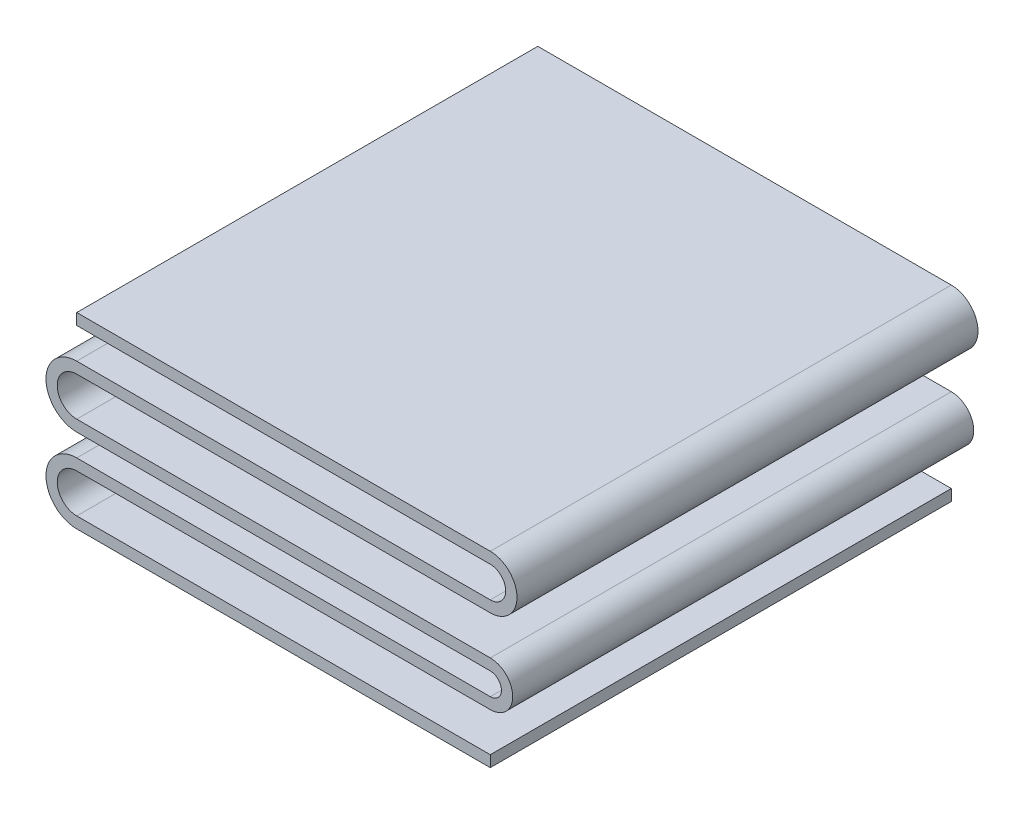
ISO-10303-21;
HEADER;
FILE_DESCRIPTION(('STEP AP214'),'2;1');
FILE_NAME('part.step','',(''),(''),'','','');
FILE_SCHEMA(('AUTOMOTIVE_DESIGN { 1 0 10303 214 1 1 1 1 }'));
ENDSEC;
DATA;
#1=APPLICATION_CONTEXT('core data for automotive mechanical design processes');
#2=APPLICATION_PROTOCOL_DEFINITION('international standard','automotive_design',2000,#1);
#3=PRODUCT_CONTEXT('',#1,'mechanical');
#4=PRODUCT('Part','Part','',(#3));
#5=PRODUCT_RELATED_PRODUCT_CATEGORY('part','',(#4));
#6=PRODUCT_DEFINITION_FORMATION('','',#4);
#7=PRODUCT_DEFINITION_CONTEXT('part definition',#1,'design');
#8=PRODUCT_DEFINITION('design','',#6,#7);
#9=PRODUCT_DEFINITION_SHAPE('','',#8);
#10=(LENGTH_UNIT() NAMED_UNIT(*) SI_UNIT(.MILLI.,.METRE.));
#11=(NAMED_UNIT(*) PLANE_ANGLE_UNIT() SI_UNIT($,.RADIAN.));
#12=(NAMED_UNIT(*) SI_UNIT($,.STERADIAN.) SOLID_ANGLE_UNIT());
#13=UNCERTAINTY_MEASURE_WITH_UNIT(LENGTH_MEASURE(1.E-05),#10,'distance_accuracy_value','');
#14=(GEOMETRIC_REPRESENTATION_CONTEXT(3) GLOBAL_UNCERTAINTY_ASSIGNED_CONTEXT((#13)) GLOBAL_UNIT_ASSIGNED_CONTEXT((#10,
#11,#12)) REPRESENTATION_CONTEXT('',''));
#15=CARTESIAN_POINT('',(0.,0.,0.));
#16=DIRECTION('',(0.,0.,1.));
#17=DIRECTION('',(1.,0.,0.));
#18=AXIS2_PLACEMENT_3D('',#15,#16,#17);
#19=CARTESIAN_POINT('',(-7.00550510540419,0.660795162104659,15.621));
#20=DIRECTION('',(0.,0.,-1.));
#21=DIRECTION('',(-1.,0.,0.));
#22=AXIS2_PLACEMENT_3D('',#19,#20,#21);
#23=CYLINDRICAL_SURFACE('',#22,0.660795162104659);
#24=CARTESIAN_POINT('',(-7.00550510540419,0.660795162104659,0.));
#25=DIRECTION('',(0.,0.,-1.));
#26=DIRECTION('',(-1.,0.,0.));
#27=AXIS2_PLACEMENT_3D('',#24,#25,#26);
#28=CIRCLE('',#27,0.660795162104659);
#29=CARTESIAN_POINT('',(-7.00550510540419,0.,0.));
#30=VERTEX_POINT('',#29);
#31=CARTESIAN_POINT('',(-7.00550510540419,1.32159032420932,0.));
#32=VERTEX_POINT('',#31);
#33=EDGE_CURVE('E218',#30,#32,#28,.T.);
#34=ORIENTED_EDGE('',*,*,#33,.T.);
#35=DIRECTION('',(0.,0.,-1.));
#36=VECTOR('',#35,1.);
#37=CARTESIAN_POINT('',(-7.00550510540419,1.32159032420932,15.621));
#38=LINE('',#37,#36);
#39=CARTESIAN_POINT('',(-7.00550510540419,1.32159032420932,15.621));
#40=VERTEX_POINT('',#39);
#41=EDGE_CURVE('E11',#40,#32,#38,.T.);
#42=ORIENTED_EDGE('',*,*,#41,.F.);
#43=CARTESIAN_POINT('',(-7.00550510540419,0.660795162104659,15.621));
#44=DIRECTION('',(0.,0.,-1.));
#45=DIRECTION('',(-1.,0.,0.));
#46=AXIS2_PLACEMENT_3D('',#43,#44,#45);
#47=CIRCLE('',#46,0.660795162104659);
#48=CARTESIAN_POINT('',(-7.00550510540419,0.,15.621));
#49=VERTEX_POINT('',#48);
#50=EDGE_CURVE('E276',#49,#40,#47,.T.);
#51=ORIENTED_EDGE('',*,*,#50,.F.);
#52=DIRECTION('',(0.,0.,-1.));
#53=VECTOR('',#52,1.);
#54=CARTESIAN_POINT('',(-7.00550510540419,0.,15.621));
#55=LINE('',#54,#53);
#56=EDGE_CURVE('E214',#49,#30,#55,.T.);
#57=ORIENTED_EDGE('',*,*,#56,.T.);
#58=EDGE_LOOP('',(#34,#42,#51,#57));
#59=FACE_BOUND('',#58,.T.);
#60=ADVANCED_FACE('F45',(#59),#23,.F.);
#61=CARTESIAN_POINT('',(-7.00550510540419,1.32159032420932,15.621));
#62=DIRECTION('',(0.,1.,0.));
#63=DIRECTION('',(0.,0.,1.));
#64=AXIS2_PLACEMENT_3D('',#61,#62,#63);
#65=PLANE('',#64);
#66=DIRECTION('',(1.,0.,0.));
#67=VECTOR('',#66,1.);
#68=CARTESIAN_POINT('',(-7.00550510540419,1.32159032420932,0.));
#69=LINE('',#68,#67);
#70=CARTESIAN_POINT('',(7.00550510540419,1.32159032420932,0.));
#71=VERTEX_POINT('',#70);
#72=EDGE_CURVE('E222',#32,#71,#69,.T.);
#73=ORIENTED_EDGE('',*,*,#72,.T.);
#74=DIRECTION('',(0.,0.,-1.));
#75=VECTOR('',#74,1.);
#76=CARTESIAN_POINT('',(7.00550510540419,1.32159032420932,15.621));
#77=LINE('',#76,#75);
#78=CARTESIAN_POINT('',(7.00550510540419,1.32159032420932,15.621));
#79=VERTEX_POINT('',#78);
#80=EDGE_CURVE('E54',#79,#71,#77,.T.);
#81=ORIENTED_EDGE('',*,*,#80,.F.);
#82=DIRECTION('',(1.,0.,0.));
#83=VECTOR('',#82,1.);
#84=CARTESIAN_POINT('',(-7.00550510540419,1.32159032420932,15.621));
#85=LINE('',#84,#83);
#86=EDGE_CURVE('E141',#40,#79,#85,.T.);
#87=ORIENTED_EDGE('',*,*,#86,.F.);
#88=ORIENTED_EDGE('',*,*,#41,.T.);
#89=EDGE_LOOP('',(#73,#81,#87,#88));
#90=FACE_BOUND('',#89,.T.);
#91=ADVANCED_FACE('F426',(#90),#65,.F.);
#92=CARTESIAN_POINT('',(7.00550510540419,2.2252937493264,15.621));
#93=DIRECTION('',(0.,0.,-1.));
#94=DIRECTION('',(-1.,0.,0.));
#95=AXIS2_PLACEMENT_3D('',#92,#93,#94);
#96=CYLINDRICAL_SURFACE('',#95,0.903703425117078);
#97=CARTESIAN_POINT('',(7.00550510540419,2.2252937493264,0.));
#98=DIRECTION('',(0.,0.,1.));
#99=DIRECTION('',(1.,0.,0.));
#100=AXIS2_PLACEMENT_3D('',#97,#98,#99);
#101=CIRCLE('',#100,0.903703425117078);
#102=CARTESIAN_POINT('',(7.00550510540419,3.12899717444347,0.));
#103=VERTEX_POINT('',#102);
#104=EDGE_CURVE('E225',#71,#103,#101,.T.);
#105=ORIENTED_EDGE('',*,*,#104,.T.);
#106=DIRECTION('',(0.,0.,-1.));
#107=VECTOR('',#106,1.);
#108=CARTESIAN_POINT('',(7.00550510540419,3.12899717444347,15.621));
#109=LINE('',#108,#107);
#110=CARTESIAN_POINT('',(7.00550510540419,3.12899717444347,15.621));
#111=VERTEX_POINT('',#110);
#112=EDGE_CURVE('E335',#111,#103,#109,.T.);
#113=ORIENTED_EDGE('',*,*,#112,.F.);
#114=CARTESIAN_POINT('',(7.00550510540419,2.2252937493264,15.621));
#115=DIRECTION('',(0.,0.,1.));
#116=DIRECTION('',(1.,0.,0.));
#117=AXIS2_PLACEMENT_3D('',#114,#115,#116);
#118=CIRCLE('',#117,0.903703425117078);
#119=EDGE_CURVE('E345',#79,#111,#118,.T.);
#120=ORIENTED_EDGE('',*,*,#119,.F.);
#121=ORIENTED_EDGE('',*,*,#80,.T.);
#122=EDGE_LOOP('',(#105,#113,#120,#121));
#123=FACE_BOUND('',#122,.T.);
#124=ADVANCED_FACE('F343',(#123),#96,.T.);
#125=CARTESIAN_POINT('',(7.00550510540419,3.12899717444347,15.621));
#126=DIRECTION('',(0.,-1.,0.));
#127=DIRECTION('',(0.,0.,-1.));
#128=AXIS2_PLACEMENT_3D('',#125,#126,#127);
#129=PLANE('',#128);
#130=DIRECTION('',(-1.,0.,0.));
#131=VECTOR('',#130,1.);
#132=CARTESIAN_POINT('',(7.00550510540419,3.12899717444347,0.));
#133=LINE('',#132,#131);
#134=CARTESIAN_POINT('',(-7.0055051054042,3.12899717444347,0.));
#135=VERTEX_POINT('',#134);
#136=EDGE_CURVE('E228',#103,#135,#133,.T.);
#137=ORIENTED_EDGE('',*,*,#136,.T.);
#138=DIRECTION('',(0.,0.,-1.));
#139=VECTOR('',#138,1.);
#140=CARTESIAN_POINT('',(-7.0055051054042,3.12899717444347,15.621));
#141=LINE('',#140,#139);
#142=CARTESIAN_POINT('',(-7.0055051054042,3.12899717444347,15.621));
#143=VERTEX_POINT('',#142);
#144=EDGE_CURVE('E331',#143,#135,#141,.T.);
#145=ORIENTED_EDGE('',*,*,#144,.F.);
#146=DIRECTION('',(-1.,0.,0.));
#147=VECTOR('',#146,1.);
#148=CARTESIAN_POINT('',(7.00550510540419,3.12899717444347,15.621));
#149=LINE('',#148,#147);
#150=EDGE_CURVE('E364',#111,#143,#149,.T.);
#151=ORIENTED_EDGE('',*,*,#150,.F.);
#152=ORIENTED_EDGE('',*,*,#112,.T.);
#153=EDGE_LOOP('',(#137,#145,#151,#152));
#154=FACE_BOUND('',#153,.T.);
#155=ADVANCED_FACE('F354',(#154),#129,.F.);
#156=CARTESIAN_POINT('',(-7.0055051054042,3.12899717444347,15.621));
#157=DIRECTION('',(1.,0.,0.));
#158=DIRECTION('',(0.,1.,0.));
#159=AXIS2_PLACEMENT_3D('',#156,#157,#158);
#160=PLANE('',#159);
#161=DIRECTION('',(0.,-1.,0.));
#162=VECTOR('',#161,1.);
#163=CARTESIAN_POINT('',(-7.0055051054042,3.12899717444347,0.));
#164=LINE('',#163,#162);
#165=CARTESIAN_POINT('',(-7.00550510540419,2.74799717444347,0.));
#166=VERTEX_POINT('',#165);
#167=EDGE_CURVE('E231',#135,#166,#164,.T.);
#168=ORIENTED_EDGE('',*,*,#167,.T.);
#169=DIRECTION('',(0.,0.,-1.));
#170=VECTOR('',#169,1.);
#171=CARTESIAN_POINT('',(-7.00550510540419,2.74799717444347,15.621));
#172=LINE('',#171,#170);
#173=CARTESIAN_POINT('',(-7.00550510540419,2.74799717444347,15.621));
#174=VERTEX_POINT('',#173);
#175=EDGE_CURVE('E327',#174,#166,#172,.T.);
#176=ORIENTED_EDGE('',*,*,#175,.F.);
#177=DIRECTION('',(0.,-1.,0.));
#178=VECTOR('',#177,1.);
#179=CARTESIAN_POINT('',(-7.0055051054042,3.12899717444347,15.621));
#180=LINE('',#179,#178);
#181=EDGE_CURVE('E360',#143,#174,#180,.T.);
#182=ORIENTED_EDGE('',*,*,#181,.F.);
#183=ORIENTED_EDGE('',*,*,#144,.T.);
#184=EDGE_LOOP('',(#168,#176,#182,#183));
#185=FACE_BOUND('',#184,.T.);
#186=ADVANCED_FACE('F358',(#185),#160,.F.);
#187=CARTESIAN_POINT('',(7.00550510540419,2.74799717444347,15.621));
#188=DIRECTION('',(0.,1.,0.));
#189=DIRECTION('',(-1.,0.,0.));
#190=AXIS2_PLACEMENT_3D('',#187,#188,#189);
#191=PLANE('',#190);
#192=DIRECTION('',(1.,0.,0.));
#193=VECTOR('',#192,1.);
#194=CARTESIAN_POINT('',(7.00550510540419,2.74799717444347,0.));
#195=LINE('',#194,#193);
#196=CARTESIAN_POINT('',(7.00550510540419,2.74799717444347,0.));
#197=VERTEX_POINT('',#196);
#198=EDGE_CURVE('E234',#166,#197,#195,.T.);
#199=ORIENTED_EDGE('',*,*,#198,.T.);
#200=DIRECTION('',(0.,0.,-1.));
#201=VECTOR('',#200,1.);
#202=CARTESIAN_POINT('',(7.00550510540419,2.74799717444347,15.621));
#203=LINE('',#202,#201);
#204=CARTESIAN_POINT('',(7.00550510540419,2.74799717444347,15.621));
#205=VERTEX_POINT('',#204);
#206=EDGE_CURVE('E323',#205,#197,#203,.T.);
#207=ORIENTED_EDGE('',*,*,#206,.F.);
#208=DIRECTION('',(1.,0.,0.));
#209=VECTOR('',#208,1.);
#210=CARTESIAN_POINT('',(7.00550510540419,2.74799717444347,15.621));
#211=LINE('',#210,#209);
#212=EDGE_CURVE('E363',#174,#205,#211,.T.);
#213=ORIENTED_EDGE('',*,*,#212,.F.);
#214=ORIENTED_EDGE('',*,*,#175,.T.);
#215=EDGE_LOOP('',(#199,#207,#213,#214));
#216=FACE_BOUND('',#215,.T.);
#217=ADVANCED_FACE('F439',(#216),#191,.F.);
#218=CARTESIAN_POINT('',(7.00550510540419,2.2252937493264,15.621));
#219=DIRECTION('',(0.,0.,-1.));
#220=DIRECTION('',(-1.,0.,0.));
#221=AXIS2_PLACEMENT_3D('',#218,#219,#220);
#222=CYLINDRICAL_SURFACE('',#221,0.522703425117078);
#223=CARTESIAN_POINT('',(7.00550510540419,2.2252937493264,0.));
#224=DIRECTION('',(0.,0.,-1.));
#225=DIRECTION('',(1.,0.,0.));
#226=AXIS2_PLACEMENT_3D('',#223,#224,#225);
#227=CIRCLE('',#226,0.522703425117078);
#228=CARTESIAN_POINT('',(7.00550510540419,1.70259032420932,0.));
#229=VERTEX_POINT('',#228);
#230=EDGE_CURVE('E237',#197,#229,#227,.T.);
#231=ORIENTED_EDGE('',*,*,#230,.T.);
#232=DIRECTION('',(0.,0.,-1.));
#233=VECTOR('',#232,1.);
#234=CARTESIAN_POINT('',(7.00550510540419,1.70259032420932,15.621));
#235=LINE('',#234,#233);
#236=CARTESIAN_POINT('',(7.00550510540419,1.70259032420932,15.621));
#237=VERTEX_POINT('',#236);
#238=EDGE_CURVE('E319',#237,#229,#235,.T.);
#239=ORIENTED_EDGE('',*,*,#238,.F.);
#240=CARTESIAN_POINT('',(7.00550510540419,2.2252937493264,15.621));
#241=DIRECTION('',(0.,0.,-1.));
#242=DIRECTION('',(1.,0.,0.));
#243=AXIS2_PLACEMENT_3D('',#240,#241,#242);
#244=CIRCLE('',#243,0.522703425117078);
#245=EDGE_CURVE('E368',#205,#237,#244,.T.);
#246=ORIENTED_EDGE('',*,*,#245,.F.);
#247=ORIENTED_EDGE('',*,*,#206,.T.);
#248=EDGE_LOOP('',(#231,#239,#246,#247));
#249=FACE_BOUND('',#248,.T.);
#250=ADVANCED_FACE('F442',(#249),#222,.F.);
#251=CARTESIAN_POINT('',(-7.00550510540419,1.70259032420932,15.621));
#252=DIRECTION('',(0.,-1.,0.));
#253=DIRECTION('',(0.,0.,-1.));
#254=AXIS2_PLACEMENT_3D('',#251,#252,#253);
#255=PLANE('',#254);
#256=DIRECTION('',(-1.,0.,0.));
#257=VECTOR('',#256,1.);
#258=CARTESIAN_POINT('',(-7.00550510540419,1.70259032420932,0.));
#259=LINE('',#258,#257);
#260=CARTESIAN_POINT('',(-7.00550510540419,1.70259032420932,0.));
#261=VERTEX_POINT('',#260);
#262=EDGE_CURVE('E240',#229,#261,#259,.T.);
#263=ORIENTED_EDGE('',*,*,#262,.T.);
#264=DIRECTION('',(0.,0.,-1.));
#265=VECTOR('',#264,1.);
#266=CARTESIAN_POINT('',(-7.00550510540419,1.70259032420932,15.621));
#267=LINE('',#266,#265);
#268=CARTESIAN_POINT('',(-7.00550510540419,1.70259032420932,15.621));
#269=VERTEX_POINT('',#268);
#270=EDGE_CURVE('E315',#269,#261,#267,.T.);
#271=ORIENTED_EDGE('',*,*,#270,.F.);
#272=DIRECTION('',(-1.,0.,0.));
#273=VECTOR('',#272,1.);
#274=CARTESIAN_POINT('',(-7.00550510540419,1.70259032420932,15.621));
#275=LINE('',#274,#273);
#276=EDGE_CURVE('E375',#237,#269,#275,.T.);
#277=ORIENTED_EDGE('',*,*,#276,.F.);
#278=ORIENTED_EDGE('',*,*,#238,.T.);
#279=EDGE_LOOP('',(#263,#271,#277,#278));
#280=FACE_BOUND('',#279,.T.);
#281=ADVANCED_FACE('F446',(#280),#255,.F.);
#282=CARTESIAN_POINT('',(-7.00550510540419,0.660795162104659,15.621));
#283=DIRECTION('',(0.,0.,-1.));
#284=DIRECTION('',(-1.,0.,0.));
#285=AXIS2_PLACEMENT_3D('',#282,#283,#284);
#286=CYLINDRICAL_SURFACE('',#285,1.04179516210466);
#287=CARTESIAN_POINT('',(-7.00550510540419,0.660795162104659,0.));
#288=DIRECTION('',(0.,0.,1.));
#289=DIRECTION('',(-1.,0.,0.));
#290=AXIS2_PLACEMENT_3D('',#287,#288,#289);
#291=CIRCLE('',#290,1.04179516210466);
#292=CARTESIAN_POINT('',(-7.00550510540419,-0.381,0.));
#293=VERTEX_POINT('',#292);
#294=EDGE_CURVE('E243',#261,#293,#291,.T.);
#295=ORIENTED_EDGE('',*,*,#294,.T.);
#296=DIRECTION('',(0.,0.,-1.));
#297=VECTOR('',#296,1.);
#298=CARTESIAN_POINT('',(-7.00550510540419,-0.381,15.621));
#299=LINE('',#298,#297);
#300=CARTESIAN_POINT('',(-7.00550510540419,-0.381,15.621));
#301=VERTEX_POINT('',#300);
#302=EDGE_CURVE('E311',#301,#293,#299,.T.);
#303=ORIENTED_EDGE('',*,*,#302,.F.);
#304=CARTESIAN_POINT('',(-7.00550510540419,0.660795162104659,15.621));
#305=DIRECTION('',(0.,0.,1.));
#306=DIRECTION('',(-1.,0.,0.));
#307=AXIS2_PLACEMENT_3D('',#304,#305,#306);
#308=CIRCLE('',#307,1.04179516210466);
#309=EDGE_CURVE('E378',#269,#301,#308,.T.);
#310=ORIENTED_EDGE('',*,*,#309,.F.);
#311=ORIENTED_EDGE('',*,*,#270,.T.);
#312=EDGE_LOOP('',(#295,#303,#310,#311));
#313=FACE_BOUND('',#312,.T.);
#314=ADVANCED_FACE('F450',(#313),#286,.T.);
#315=CARTESIAN_POINT('',(-7.00550510540419,-0.381,15.621));
#316=DIRECTION('',(0.,1.,0.));
#317=DIRECTION('',(0.,0.,1.));
#318=AXIS2_PLACEMENT_3D('',#315,#316,#317);
#319=PLANE('',#318);
#320=DIRECTION('',(1.,0.,0.));
#321=VECTOR('',#320,1.);
#322=CARTESIAN_POINT('',(-7.00550510540419,-0.381,0.));
#323=LINE('',#322,#321);
#324=CARTESIAN_POINT('',(7.00550510540419,-0.381,0.));
#325=VERTEX_POINT('',#324);
#326=EDGE_CURVE('E246',#293,#325,#323,.T.);
#327=ORIENTED_EDGE('',*,*,#326,.T.);
#328=DIRECTION('',(0.,0.,-1.));
#329=VECTOR('',#328,1.);
#330=CARTESIAN_POINT('',(7.00550510540419,-0.381,15.621));
#331=LINE('',#330,#329);
#332=CARTESIAN_POINT('',(7.00550510540419,-0.381,15.621));
#333=VERTEX_POINT('',#332);
#334=EDGE_CURVE('E307',#333,#325,#331,.T.);
#335=ORIENTED_EDGE('',*,*,#334,.F.);
#336=DIRECTION('',(1.,0.,0.));
#337=VECTOR('',#336,1.);
#338=CARTESIAN_POINT('',(-7.00550510540419,-0.381,15.621));
#339=LINE('',#338,#337);
#340=EDGE_CURVE('E381',#301,#333,#339,.T.);
#341=ORIENTED_EDGE('',*,*,#340,.F.);
#342=ORIENTED_EDGE('',*,*,#302,.T.);
#343=EDGE_LOOP('',(#327,#335,#341,#342));
#344=FACE_BOUND('',#343,.T.);
#345=ADVANCED_FACE('F454',(#344),#319,.F.);
#346=CARTESIAN_POINT('',(7.00550510540419,-0.759206250673604,15.621));
#347=DIRECTION('',(0.,0.,-1.));
#348=DIRECTION('',(-1.,0.,0.));
#349=AXIS2_PLACEMENT_3D('',#346,#347,#348);
#350=CYLINDRICAL_SURFACE('',#349,0.378206250673604);
#351=CARTESIAN_POINT('',(7.00550510540419,-0.759206250673604,0.));
#352=DIRECTION('',(0.,0.,-1.));
#353=DIRECTION('',(-1.,0.,0.));
#354=AXIS2_PLACEMENT_3D('',#351,#352,#353);
#355=CIRCLE('',#354,0.378206250673604);
#356=CARTESIAN_POINT('',(7.00550510540419,-1.13741250134721,0.));
#357=VERTEX_POINT('',#356);
#358=EDGE_CURVE('E249',#325,#357,#355,.T.);
#359=ORIENTED_EDGE('',*,*,#358,.T.);
#360=DIRECTION('',(0.,0.,-1.));
#361=VECTOR('',#360,1.);
#362=CARTESIAN_POINT('',(7.00550510540419,-1.13741250134721,15.621));
#363=LINE('',#362,#361);
#364=CARTESIAN_POINT('',(7.00550510540419,-1.13741250134721,15.621));
#365=VERTEX_POINT('',#364);
#366=EDGE_CURVE('E303',#365,#357,#363,.T.);
#367=ORIENTED_EDGE('',*,*,#366,.F.);
#368=CARTESIAN_POINT('',(7.00550510540419,-0.759206250673604,15.621));
#369=DIRECTION('',(0.,0.,-1.));
#370=DIRECTION('',(-1.,0.,0.));
#371=AXIS2_PLACEMENT_3D('',#368,#369,#370);
#372=CIRCLE('',#371,0.378206250673604);
#373=EDGE_CURVE('E384',#333,#365,#372,.T.);
#374=ORIENTED_EDGE('',*,*,#373,.F.);
#375=ORIENTED_EDGE('',*,*,#334,.T.);
#376=EDGE_LOOP('',(#359,#367,#374,#375));
#377=FACE_BOUND('',#376,.T.);
#378=ADVANCED_FACE('F458',(#377),#350,.F.);
#379=CARTESIAN_POINT('',(7.00550510540419,-1.13741250134721,15.621));
#380=DIRECTION('',(0.,-1.,0.));
#381=DIRECTION('',(0.,0.,-1.));
#382=AXIS2_PLACEMENT_3D('',#379,#380,#381);
#383=PLANE('',#382);
#384=DIRECTION('',(-1.,0.,0.));
#385=VECTOR('',#384,1.);
#386=CARTESIAN_POINT('',(7.00550510540419,-1.13741250134721,0.));
#387=LINE('',#386,#385);
#388=CARTESIAN_POINT('',(-7.00550510540419,-1.13741250134721,0.));
#389=VERTEX_POINT('',#388);
#390=EDGE_CURVE('E252',#357,#389,#387,.T.);
#391=ORIENTED_EDGE('',*,*,#390,.T.);
#392=DIRECTION('',(0.,0.,-1.));
#393=VECTOR('',#392,1.);
#394=CARTESIAN_POINT('',(-7.00550510540419,-1.13741250134721,15.621));
#395=LINE('',#394,#393);
#396=CARTESIAN_POINT('',(-7.00550510540419,-1.13741250134721,15.621));
#397=VERTEX_POINT('',#396);
#398=EDGE_CURVE('E299',#397,#389,#395,.T.);
#399=ORIENTED_EDGE('',*,*,#398,.F.);
#400=DIRECTION('',(-1.,0.,0.));
#401=VECTOR('',#400,1.);
#402=CARTESIAN_POINT('',(7.00550510540419,-1.13741250134721,15.621));
#403=LINE('',#402,#401);
#404=EDGE_CURVE('E387',#365,#397,#403,.T.);
#405=ORIENTED_EDGE('',*,*,#404,.F.);
#406=ORIENTED_EDGE('',*,*,#366,.T.);
#407=EDGE_LOOP('',(#391,#399,#405,#406));
#408=FACE_BOUND('',#407,.T.);
#409=ADVANCED_FACE('F462',(#408),#383,.F.);
#410=CARTESIAN_POINT('',(-7.00550510540419,-2.17920766345187,15.621));
#411=DIRECTION('',(0.,0.,-1.));
#412=DIRECTION('',(-1.,0.,0.));
#413=AXIS2_PLACEMENT_3D('',#410,#411,#412);
#414=CYLINDRICAL_SURFACE('',#413,1.04179516210466);
#415=CARTESIAN_POINT('',(-7.00550510540419,-2.17920766345187,0.));
#416=DIRECTION('',(0.,0.,1.));
#417=DIRECTION('',(1.,0.,0.));
#418=AXIS2_PLACEMENT_3D('',#415,#416,#417);
#419=CIRCLE('',#418,1.04179516210466);
#420=CARTESIAN_POINT('',(-7.00550510540419,-3.22100282555653,0.));
#421=VERTEX_POINT('',#420);
#422=EDGE_CURVE('E255',#389,#421,#419,.T.);
#423=ORIENTED_EDGE('',*,*,#422,.T.);
#424=DIRECTION('',(0.,0.,-1.));
#425=VECTOR('',#424,1.);
#426=CARTESIAN_POINT('',(-7.00550510540419,-3.22100282555653,15.621));
#427=LINE('',#426,#425);
#428=CARTESIAN_POINT('',(-7.00550510540419,-3.22100282555653,15.621));
#429=VERTEX_POINT('',#428);
#430=EDGE_CURVE('E295',#429,#421,#427,.T.);
#431=ORIENTED_EDGE('',*,*,#430,.F.);
#432=CARTESIAN_POINT('',(-7.00550510540419,-2.17920766345187,15.621));
#433=DIRECTION('',(0.,0.,1.));
#434=DIRECTION('',(1.,0.,0.));
#435=AXIS2_PLACEMENT_3D('',#432,#433,#434);
#436=CIRCLE('',#435,1.04179516210466);
#437=EDGE_CURVE('E390',#397,#429,#436,.T.);
#438=ORIENTED_EDGE('',*,*,#437,.F.);
#439=ORIENTED_EDGE('',*,*,#398,.T.);
#440=EDGE_LOOP('',(#423,#431,#438,#439));
#441=FACE_BOUND('',#440,.T.);
#442=ADVANCED_FACE('F466',(#441),#414,.T.);
#443=CARTESIAN_POINT('',(-7.00550510540419,-3.22100282555653,15.621));
#444=DIRECTION('',(0.,1.,0.));
#445=DIRECTION('',(0.,0.,1.));
#446=AXIS2_PLACEMENT_3D('',#443,#444,#445);
#447=PLANE('',#446);
#448=DIRECTION('',(1.,0.,0.));
#449=VECTOR('',#448,1.);
#450=CARTESIAN_POINT('',(-7.00550510540419,-3.22100282555653,0.));
#451=LINE('',#450,#449);
#452=CARTESIAN_POINT('',(7.00550510540419,-3.22100282555653,0.));
#453=VERTEX_POINT('',#452);
#454=EDGE_CURVE('E258',#421,#453,#451,.T.);
#455=ORIENTED_EDGE('',*,*,#454,.T.);
#456=DIRECTION('',(0.,0.,-1.));
#457=VECTOR('',#456,1.);
#458=CARTESIAN_POINT('',(7.00550510540419,-3.22100282555653,15.621));
#459=LINE('',#458,#457);
#460=CARTESIAN_POINT('',(7.00550510540419,-3.22100282555653,15.621));
#461=VERTEX_POINT('',#460);
#462=EDGE_CURVE('E291',#461,#453,#459,.T.);
#463=ORIENTED_EDGE('',*,*,#462,.F.);
#464=DIRECTION('',(1.,0.,0.));
#465=VECTOR('',#464,1.);
#466=CARTESIAN_POINT('',(-7.00550510540419,-3.22100282555653,15.621));
#467=LINE('',#466,#465);
#468=EDGE_CURVE('E393',#429,#461,#467,.T.);
#469=ORIENTED_EDGE('',*,*,#468,.F.);
#470=ORIENTED_EDGE('',*,*,#430,.T.);
#471=EDGE_LOOP('',(#455,#463,#469,#470));
#472=FACE_BOUND('',#471,.T.);
#473=ADVANCED_FACE('F470',(#472),#447,.F.);
#474=CARTESIAN_POINT('',(7.00550510540419,-3.22100282555653,15.621));
#475=DIRECTION('',(-1.,0.,0.));
#476=DIRECTION('',(0.,-1.,0.));
#477=AXIS2_PLACEMENT_3D('',#474,#475,#476);
#478=PLANE('',#477);
#479=DIRECTION('',(0.,1.,0.));
#480=VECTOR('',#479,1.);
#481=CARTESIAN_POINT('',(7.00550510540419,-3.22100282555653,0.));
#482=LINE('',#481,#480);
#483=CARTESIAN_POINT('',(7.00550510540419,-2.84000282555653,0.));
#484=VERTEX_POINT('',#483);
#485=EDGE_CURVE('E261',#453,#484,#482,.T.);
#486=ORIENTED_EDGE('',*,*,#485,.T.);
#487=DIRECTION('',(0.,0.,-1.));
#488=VECTOR('',#487,1.);
#489=CARTESIAN_POINT('',(7.00550510540419,-2.84000282555653,15.621));
#490=LINE('',#489,#488);
#491=CARTESIAN_POINT('',(7.00550510540419,-2.84000282555653,15.621));
#492=VERTEX_POINT('',#491);
#493=EDGE_CURVE('E287',#492,#484,#490,.T.);
#494=ORIENTED_EDGE('',*,*,#493,.F.);
#495=DIRECTION('',(0.,1.,0.));
#496=VECTOR('',#495,1.);
#497=CARTESIAN_POINT('',(7.00550510540419,-3.22100282555653,15.621));
#498=LINE('',#497,#496);
#499=EDGE_CURVE('E396',#461,#492,#498,.T.);
#500=ORIENTED_EDGE('',*,*,#499,.F.);
#501=ORIENTED_EDGE('',*,*,#462,.T.);
#502=EDGE_LOOP('',(#486,#494,#500,#501));
#503=FACE_BOUND('',#502,.T.);
#504=ADVANCED_FACE('F474',(#503),#478,.F.);
#505=CARTESIAN_POINT('',(-7.00550510540419,-2.84000282555653,15.621));
#506=DIRECTION('',(0.,-1.,0.));
#507=DIRECTION('',(0.,0.,-1.));
#508=AXIS2_PLACEMENT_3D('',#505,#506,#507);
#509=PLANE('',#508);
#510=DIRECTION('',(-1.,0.,0.));
#511=VECTOR('',#510,1.);
#512=CARTESIAN_POINT('',(-7.00550510540419,-2.84000282555653,0.));
#513=LINE('',#512,#511);
#514=CARTESIAN_POINT('',(-7.00550510540419,-2.84000282555653,0.));
#515=VERTEX_POINT('',#514);
#516=EDGE_CURVE('E264',#484,#515,#513,.T.);
#517=ORIENTED_EDGE('',*,*,#516,.T.);
#518=DIRECTION('',(0.,0.,-1.));
#519=VECTOR('',#518,1.);
#520=CARTESIAN_POINT('',(-7.00550510540419,-2.84000282555653,15.621));
#521=LINE('',#520,#519);
#522=CARTESIAN_POINT('',(-7.00550510540419,-2.84000282555653,15.621));
#523=VERTEX_POINT('',#522);
#524=EDGE_CURVE('E283',#523,#515,#521,.T.);
#525=ORIENTED_EDGE('',*,*,#524,.F.);
#526=DIRECTION('',(-1.,0.,0.));
#527=VECTOR('',#526,1.);
#528=CARTESIAN_POINT('',(-7.00550510540419,-2.84000282555653,15.621));
#529=LINE('',#528,#527);
#530=EDGE_CURVE('E399',#492,#523,#529,.T.);
#531=ORIENTED_EDGE('',*,*,#530,.F.);
#532=ORIENTED_EDGE('',*,*,#493,.T.);
#533=EDGE_LOOP('',(#517,#525,#531,#532));
#534=FACE_BOUND('',#533,.T.);
#535=ADVANCED_FACE('F407',(#534),#509,.F.);
#536=CARTESIAN_POINT('',(-7.00550510540419,-2.17920766345187,15.621));
#537=DIRECTION('',(0.,0.,-1.));
#538=DIRECTION('',(-1.,0.,0.));
#539=AXIS2_PLACEMENT_3D('',#536,#537,#538);
#540=CYLINDRICAL_SURFACE('',#539,0.660795162104659);
#541=CARTESIAN_POINT('',(-7.00550510540419,-2.17920766345187,0.));
#542=DIRECTION('',(0.,0.,-1.));
#543=DIRECTION('',(1.,0.,0.));
#544=AXIS2_PLACEMENT_3D('',#541,#542,#543);
#545=CIRCLE('',#544,0.660795162104659);
#546=CARTESIAN_POINT('',(-7.00550510540419,-1.51841250134721,0.));
#547=VERTEX_POINT('',#546);
#548=EDGE_CURVE('E267',#515,#547,#545,.T.);
#549=ORIENTED_EDGE('',*,*,#548,.T.);
#550=DIRECTION('',(0.,0.,-1.));
#551=VECTOR('',#550,1.);
#552=CARTESIAN_POINT('',(-7.00550510540419,-1.51841250134721,15.621));
#553=LINE('',#552,#551);
#554=CARTESIAN_POINT('',(-7.00550510540419,-1.51841250134721,15.621));
#555=VERTEX_POINT('',#554);
#556=EDGE_CURVE('E207',#555,#547,#553,.T.);
#557=ORIENTED_EDGE('',*,*,#556,.F.);
#558=CARTESIAN_POINT('',(-7.00550510540419,-2.17920766345187,15.621));
#559=DIRECTION('',(0.,0.,-1.));
#560=DIRECTION('',(1.,0.,0.));
#561=AXIS2_PLACEMENT_3D('',#558,#559,#560);
#562=CIRCLE('',#561,0.660795162104659);
#563=EDGE_CURVE('E196',#523,#555,#562,.T.);
#564=ORIENTED_EDGE('',*,*,#563,.F.);
#565=ORIENTED_EDGE('',*,*,#524,.T.);
#566=EDGE_LOOP('',(#549,#557,#564,#565));
#567=FACE_BOUND('',#566,.T.);
#568=ADVANCED_FACE('F411',(#567),#540,.F.);
#569=CARTESIAN_POINT('',(7.00550510540419,-1.51841250134721,15.621));
#570=DIRECTION('',(0.,1.,0.));
#571=DIRECTION('',(-1.,0.,0.));
#572=AXIS2_PLACEMENT_3D('',#569,#570,#571);
#573=PLANE('',#572);
#574=DIRECTION('',(1.,0.,0.));
#575=VECTOR('',#574,1.);
#576=CARTESIAN_POINT('',(7.00550510540419,-1.51841250134721,0.));
#577=LINE('',#576,#575);
#578=CARTESIAN_POINT('',(7.00550510540419,-1.51841250134721,0.));
#579=VERTEX_POINT('',#578);
#580=EDGE_CURVE('E205',#547,#579,#577,.T.);
#581=ORIENTED_EDGE('',*,*,#580,.T.);
#582=DIRECTION('',(0.,0.,-1.));
#583=VECTOR('',#582,1.);
#584=CARTESIAN_POINT('',(7.00550510540419,-1.51841250134721,15.621));
#585=LINE('',#584,#583);
#586=CARTESIAN_POINT('',(7.00550510540419,-1.51841250134721,15.621));
#587=VERTEX_POINT('',#586);
#588=EDGE_CURVE('E202',#587,#579,#585,.T.);
#589=ORIENTED_EDGE('',*,*,#588,.F.);
#590=DIRECTION('',(1.,0.,0.));
#591=VECTOR('',#590,1.);
#592=CARTESIAN_POINT('',(7.00550510540419,-1.51841250134721,15.621));
#593=LINE('',#592,#591);
#594=EDGE_CURVE('E190',#555,#587,#593,.T.);
#595=ORIENTED_EDGE('',*,*,#594,.F.);
#596=ORIENTED_EDGE('',*,*,#556,.T.);
#597=EDGE_LOOP('',(#581,#589,#595,#596));
#598=FACE_BOUND('',#597,.T.);
#599=ADVANCED_FACE('F203',(#598),#573,.F.);
#600=CARTESIAN_POINT('',(7.00550510540419,-0.759206250673604,15.621));
#601=DIRECTION('',(0.,0.,-1.));
#602=DIRECTION('',(-1.,0.,0.));
#603=AXIS2_PLACEMENT_3D('',#600,#601,#602);
#604=CYLINDRICAL_SURFACE('',#603,0.759206250673604);
#605=CARTESIAN_POINT('',(7.00550510540419,-0.759206250673604,0.));
#606=DIRECTION('',(0.,0.,1.));
#607=DIRECTION('',(-1.,0.,0.));
#608=AXIS2_PLACEMENT_3D('',#605,#606,#607);
#609=CIRCLE('',#608,0.759206250673604);
#610=CARTESIAN_POINT('',(7.00550510540419,0.,0.));
#611=VERTEX_POINT('',#610);
#612=EDGE_CURVE('E127',#579,#611,#609,.T.);
#613=ORIENTED_EDGE('',*,*,#612,.T.);
#614=DIRECTION('',(0.,0.,-1.));
#615=VECTOR('',#614,1.);
#616=CARTESIAN_POINT('',(7.00550510540419,0.,15.621));
#617=LINE('',#616,#615);
#618=CARTESIAN_POINT('',(7.00550510540419,0.,15.621));
#619=VERTEX_POINT('',#618);
#620=EDGE_CURVE('E208',#619,#611,#617,.T.);
#621=ORIENTED_EDGE('',*,*,#620,.F.);
#622=CARTESIAN_POINT('',(7.00550510540419,-0.759206250673604,15.621));
#623=DIRECTION('',(0.,0.,1.));
#624=DIRECTION('',(-1.,0.,0.));
#625=AXIS2_PLACEMENT_3D('',#622,#623,#624);
#626=CIRCLE('',#625,0.759206250673604);
#627=EDGE_CURVE('E194',#587,#619,#626,.T.);
#628=ORIENTED_EDGE('',*,*,#627,.F.);
#629=ORIENTED_EDGE('',*,*,#588,.T.);
#630=EDGE_LOOP('',(#613,#621,#628,#629));
#631=FACE_BOUND('',#630,.T.);
#632=ADVANCED_FACE('F210',(#631),#604,.T.);
#633=CARTESIAN_POINT('',(-7.00550510540419,0.,15.621));
#634=DIRECTION('',(0.,-1.,0.));
#635=DIRECTION('',(1.,0.,0.));
#636=AXIS2_PLACEMENT_3D('',#633,#634,#635);
#637=PLANE('',#636);
#638=DIRECTION('',(-1.,0.,0.));
#639=VECTOR('',#638,1.);
#640=CARTESIAN_POINT('',(-7.00550510540419,0.,0.));
#641=LINE('',#640,#639);
#642=EDGE_CURVE('E133',#611,#30,#641,.T.);
#643=ORIENTED_EDGE('',*,*,#642,.T.);
#644=ORIENTED_EDGE('',*,*,#56,.F.);
#645=DIRECTION('',(-1.,0.,0.));
#646=VECTOR('',#645,1.);
#647=CARTESIAN_POINT('',(-7.00550510540419,0.,15.621));
#648=LINE('',#647,#646);
#649=EDGE_CURVE('E62',#619,#49,#648,.T.);
#650=ORIENTED_EDGE('',*,*,#649,.F.);
#651=ORIENTED_EDGE('',*,*,#620,.T.);
#652=EDGE_LOOP('',(#643,#644,#650,#651));
#653=FACE_BOUND('',#652,.T.);
#654=ADVANCED_FACE('F415',(#653),#637,.F.);
#655=CARTESIAN_POINT('',(-7.00550510540419,0.660795162104659,15.621));
#656=DIRECTION('',(0.,0.,-1.));
#657=DIRECTION('',(-1.,0.,0.));
#658=AXIS2_PLACEMENT_3D('',#655,#656,#657);
#659=PLANE('',#658);
#660=ORIENTED_EDGE('',*,*,#50,.T.);
#661=ORIENTED_EDGE('',*,*,#86,.T.);
#662=ORIENTED_EDGE('',*,*,#119,.T.);
#663=ORIENTED_EDGE('',*,*,#150,.T.);
#664=ORIENTED_EDGE('',*,*,#181,.T.);
#665=ORIENTED_EDGE('',*,*,#212,.T.);
#666=ORIENTED_EDGE('',*,*,#245,.T.);
#667=ORIENTED_EDGE('',*,*,#276,.T.);
#668=ORIENTED_EDGE('',*,*,#309,.T.);
#669=ORIENTED_EDGE('',*,*,#340,.T.);
#670=ORIENTED_EDGE('',*,*,#373,.T.);
#671=ORIENTED_EDGE('',*,*,#404,.T.);
#672=ORIENTED_EDGE('',*,*,#437,.T.);
#673=ORIENTED_EDGE('',*,*,#468,.T.);
#674=ORIENTED_EDGE('',*,*,#499,.T.);
#675=ORIENTED_EDGE('',*,*,#530,.T.);
#676=ORIENTED_EDGE('',*,*,#563,.T.);
#677=ORIENTED_EDGE('',*,*,#594,.T.);
#678=ORIENTED_EDGE('',*,*,#627,.T.);
#679=ORIENTED_EDGE('',*,*,#649,.T.);
#680=EDGE_LOOP('',(#660,#661,#662,#663,#664,#665,#666,#667,#668,#669,#670,#671,#672,#673,#674,
#675,#676,#677,#678,#679));
#681=FACE_BOUND('',#680,.T.);
#682=ADVANCED_FACE('F192',(#681),#659,.F.);
#683=CARTESIAN_POINT('',(-7.00550510540419,0.660795162104659,0.));
#684=DIRECTION('',(0.,0.,-1.));
#685=DIRECTION('',(-1.,0.,0.));
#686=AXIS2_PLACEMENT_3D('',#683,#684,#685);
#687=PLANE('',#686);
#688=ORIENTED_EDGE('',*,*,#33,.F.);
#689=ORIENTED_EDGE('',*,*,#642,.F.);
#690=ORIENTED_EDGE('',*,*,#612,.F.);
#691=ORIENTED_EDGE('',*,*,#580,.F.);
#692=ORIENTED_EDGE('',*,*,#548,.F.);
#693=ORIENTED_EDGE('',*,*,#516,.F.);
#694=ORIENTED_EDGE('',*,*,#485,.F.);
#695=ORIENTED_EDGE('',*,*,#454,.F.);
#696=ORIENTED_EDGE('',*,*,#422,.F.);
#697=ORIENTED_EDGE('',*,*,#390,.F.);
#698=ORIENTED_EDGE('',*,*,#358,.F.);
#699=ORIENTED_EDGE('',*,*,#326,.F.);
#700=ORIENTED_EDGE('',*,*,#294,.F.);
#701=ORIENTED_EDGE('',*,*,#262,.F.);
#702=ORIENTED_EDGE('',*,*,#230,.F.);
#703=ORIENTED_EDGE('',*,*,#198,.F.);
#704=ORIENTED_EDGE('',*,*,#167,.F.);
#705=ORIENTED_EDGE('',*,*,#136,.F.);
#706=ORIENTED_EDGE('',*,*,#104,.F.);
#707=ORIENTED_EDGE('',*,*,#72,.F.);
#708=EDGE_LOOP('',(#688,#689,#690,#691,#692,#693,#694,#695,#696,#697,#698,#699,#700,#701,#702,
#703,#704,#705,#706,#707));
#709=FACE_BOUND('',#708,.T.);
#710=ADVANCED_FACE('F349',(#709),#687,.T.);
#711=CLOSED_SHELL('',(#60,#91,#124,#155,#186,#217,#250,#281,#314,#345,#378,#409,#442,#473,#504,
#535,#568,#599,#632,#654,#682,#710));
#712=MANIFOLD_SOLID_BREP('B2',#711);
#713=ADVANCED_BREP_SHAPE_REPRESENTATION('',(#18,#712),#14);
#714=SHAPE_DEFINITION_REPRESENTATION(#9,#713);
ENDSEC;
END-ISO-10303-21;
